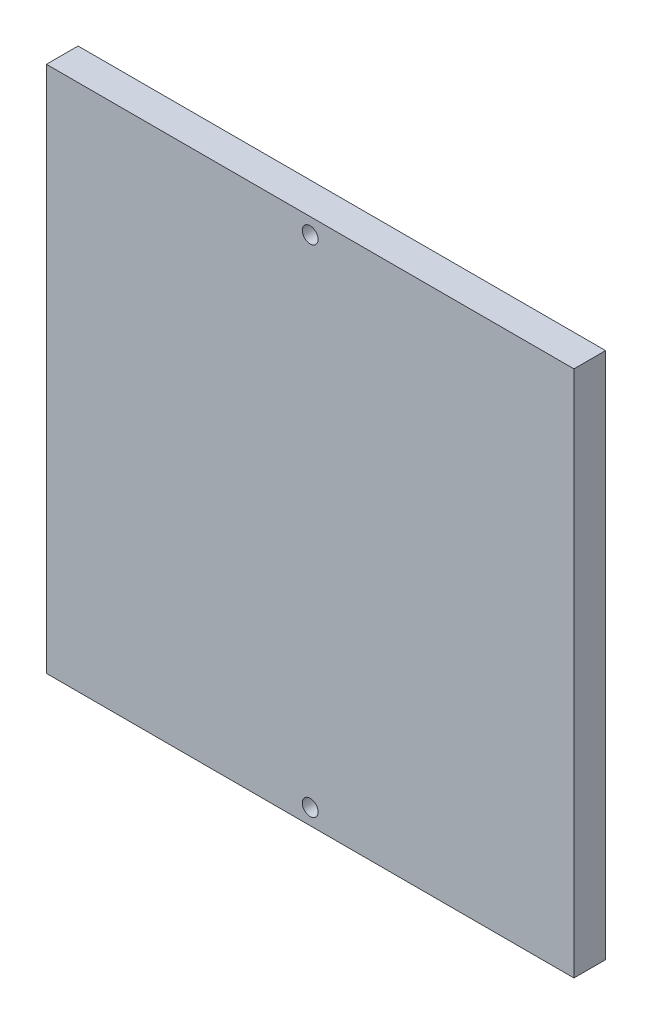
ISO-10303-21;
HEADER;
FILE_DESCRIPTION(('STEP AP214'),'2;1');
FILE_NAME('part.step','',(''),(''),'','','');
FILE_SCHEMA(('AUTOMOTIVE_DESIGN { 1 0 10303 214 1 1 1 1 }'));
ENDSEC;
DATA;
#1=APPLICATION_CONTEXT('core data for automotive mechanical design processes');
#2=APPLICATION_PROTOCOL_DEFINITION('international standard','automotive_design',2000,#1);
#3=PRODUCT_CONTEXT('',#1,'mechanical');
#4=PRODUCT('Part','Part','',(#3));
#5=PRODUCT_RELATED_PRODUCT_CATEGORY('part','',(#4));
#6=PRODUCT_DEFINITION_FORMATION('','',#4);
#7=PRODUCT_DEFINITION_CONTEXT('part definition',#1,'design');
#8=PRODUCT_DEFINITION('design','',#6,#7);
#9=PRODUCT_DEFINITION_SHAPE('','',#8);
#10=(LENGTH_UNIT() NAMED_UNIT(*) SI_UNIT(.MILLI.,.METRE.));
#11=(NAMED_UNIT(*) PLANE_ANGLE_UNIT() SI_UNIT($,.RADIAN.));
#12=(NAMED_UNIT(*) SI_UNIT($,.STERADIAN.) SOLID_ANGLE_UNIT());
#13=UNCERTAINTY_MEASURE_WITH_UNIT(LENGTH_MEASURE(1.E-05),#10,'distance_accuracy_value','');
#14=(GEOMETRIC_REPRESENTATION_CONTEXT(3) GLOBAL_UNCERTAINTY_ASSIGNED_CONTEXT((#13)) GLOBAL_UNIT_ASSIGNED_CONTEXT((#10,
#11,#12)) REPRESENTATION_CONTEXT('',''));
#15=CARTESIAN_POINT('',(0.,0.,0.));
#16=DIRECTION('',(0.,0.,1.));
#17=DIRECTION('',(1.,0.,0.));
#18=AXIS2_PLACEMENT_3D('',#15,#16,#17);
#19=CARTESIAN_POINT('',(0.,0.,6.));
#20=DIRECTION('',(0.,0.,-1.));
#21=DIRECTION('',(-1.,0.,0.));
#22=AXIS2_PLACEMENT_3D('',#19,#20,#21);
#23=PLANE('',#22);
#24=DIRECTION('',(0.,-1.,0.));
#25=VECTOR('',#24,1.);
#26=CARTESIAN_POINT('',(0.,-138.388923903618,6.));
#27=LINE('',#26,#25);
#28=CARTESIAN_POINT('',(0.,-38.3889239036183,6.));
#29=VERTEX_POINT('',#28);
#30=CARTESIAN_POINT('',(0.,-138.388923903618,6.));
#31=VERTEX_POINT('',#30);
#32=EDGE_CURVE('E89',#29,#31,#27,.T.);
#33=ORIENTED_EDGE('',*,*,#32,.T.);
#34=DIRECTION('',(1.,0.,0.));
#35=VECTOR('',#34,1.);
#36=CARTESIAN_POINT('',(100.,-138.388923903618,6.));
#37=LINE('',#36,#35);
#38=CARTESIAN_POINT('',(100.,-138.388923903618,6.));
#39=VERTEX_POINT('',#38);
#40=EDGE_CURVE('E84',#31,#39,#37,.T.);
#41=ORIENTED_EDGE('',*,*,#40,.T.);
#42=DIRECTION('',(0.,1.,0.));
#43=VECTOR('',#42,1.);
#44=CARTESIAN_POINT('',(100.,-38.3889239036183,6.));
#45=LINE('',#44,#43);
#46=CARTESIAN_POINT('',(100.,-38.3889239036183,6.));
#47=VERTEX_POINT('',#46);
#48=EDGE_CURVE('E87',#39,#47,#45,.T.);
#49=ORIENTED_EDGE('',*,*,#48,.T.);
#50=DIRECTION('',(-1.,0.,0.));
#51=VECTOR('',#50,1.);
#52=CARTESIAN_POINT('',(0.,-38.3889239036183,6.));
#53=LINE('',#52,#51);
#54=EDGE_CURVE('E54',#47,#29,#53,.T.);
#55=ORIENTED_EDGE('',*,*,#54,.T.);
#56=EDGE_LOOP('',(#33,#41,#49,#55));
#57=FACE_BOUND('',#56,.T.);
#58=CARTESIAN_POINT('',(50.,-41.3889239036183,6.));
#59=DIRECTION('',(0.,0.,1.));
#60=DIRECTION('',(1.,0.,0.));
#61=AXIS2_PLACEMENT_3D('',#58,#59,#60);
#62=CIRCLE('',#61,1.5);
#63=CARTESIAN_POINT('',(51.5,-41.3889239036183,6.));
#64=VERTEX_POINT('',#63);
#65=EDGE_CURVE('E104',#64,#64,#62,.T.);
#66=ORIENTED_EDGE('',*,*,#65,.F.);
#67=EDGE_LOOP('',(#66));
#68=FACE_BOUND('',#67,.T.);
#69=CARTESIAN_POINT('',(50.,-135.388923903618,6.));
#70=DIRECTION('',(0.,0.,1.));
#71=DIRECTION('',(1.,0.,0.));
#72=AXIS2_PLACEMENT_3D('',#69,#70,#71);
#73=CIRCLE('',#72,1.5);
#74=CARTESIAN_POINT('',(51.5,-135.388923903618,6.));
#75=VERTEX_POINT('',#74);
#76=EDGE_CURVE('E119',#75,#75,#73,.T.);
#77=ORIENTED_EDGE('',*,*,#76,.F.);
#78=EDGE_LOOP('',(#77));
#79=FACE_BOUND('',#78,.T.);
#80=ADVANCED_FACE('F37',(#57,#68,#79),#23,.F.);
#81=CARTESIAN_POINT('',(0.,0.,0.));
#82=DIRECTION('',(0.,0.,-1.));
#83=DIRECTION('',(-1.,0.,0.));
#84=AXIS2_PLACEMENT_3D('',#81,#82,#83);
#85=PLANE('',#84);
#86=CARTESIAN_POINT('',(50.,-41.3889239036183,0.));
#87=DIRECTION('',(0.,0.,1.));
#88=DIRECTION('',(1.,0.,0.));
#89=AXIS2_PLACEMENT_3D('',#86,#87,#88);
#90=CIRCLE('',#89,1.5);
#91=CARTESIAN_POINT('',(51.5,-41.3889239036183,0.));
#92=VERTEX_POINT('',#91);
#93=EDGE_CURVE('E116',#92,#92,#90,.T.);
#94=ORIENTED_EDGE('',*,*,#93,.T.);
#95=EDGE_LOOP('',(#94));
#96=FACE_BOUND('',#95,.T.);
#97=DIRECTION('',(0.,-1.,0.));
#98=VECTOR('',#97,1.);
#99=CARTESIAN_POINT('',(0.,-138.388923903618,0.));
#100=LINE('',#99,#98);
#101=CARTESIAN_POINT('',(0.,-38.3889239036183,0.));
#102=VERTEX_POINT('',#101);
#103=CARTESIAN_POINT('',(0.,-138.388923903618,0.));
#104=VERTEX_POINT('',#103);
#105=EDGE_CURVE('E101',#102,#104,#100,.T.);
#106=ORIENTED_EDGE('',*,*,#105,.F.);
#107=DIRECTION('',(-1.,0.,0.));
#108=VECTOR('',#107,1.);
#109=CARTESIAN_POINT('',(0.,-38.3889239036183,0.));
#110=LINE('',#109,#108);
#111=CARTESIAN_POINT('',(100.,-38.3889239036183,0.));
#112=VERTEX_POINT('',#111);
#113=EDGE_CURVE('E77',#112,#102,#110,.T.);
#114=ORIENTED_EDGE('',*,*,#113,.F.);
#115=DIRECTION('',(0.,1.,0.));
#116=VECTOR('',#115,1.);
#117=CARTESIAN_POINT('',(100.,-38.3889239036183,0.));
#118=LINE('',#117,#116);
#119=CARTESIAN_POINT('',(100.,-138.388923903618,0.));
#120=VERTEX_POINT('',#119);
#121=EDGE_CURVE('E71',#120,#112,#118,.T.);
#122=ORIENTED_EDGE('',*,*,#121,.F.);
#123=DIRECTION('',(1.,0.,0.));
#124=VECTOR('',#123,1.);
#125=CARTESIAN_POINT('',(100.,-138.388923903618,0.));
#126=LINE('',#125,#124);
#127=EDGE_CURVE('E93',#104,#120,#126,.T.);
#128=ORIENTED_EDGE('',*,*,#127,.F.);
#129=EDGE_LOOP('',(#106,#114,#122,#128));
#130=FACE_BOUND('',#129,.T.);
#131=CARTESIAN_POINT('',(50.,-135.388923903618,0.));
#132=DIRECTION('',(0.,0.,1.));
#133=DIRECTION('',(1.,0.,0.));
#134=AXIS2_PLACEMENT_3D('',#131,#132,#133);
#135=CIRCLE('',#134,1.5);
#136=CARTESIAN_POINT('',(51.5,-135.388923903618,0.));
#137=VERTEX_POINT('',#136);
#138=EDGE_CURVE('E122',#137,#137,#135,.T.);
#139=ORIENTED_EDGE('',*,*,#138,.T.);
#140=EDGE_LOOP('',(#139));
#141=FACE_BOUND('',#140,.T.);
#142=ADVANCED_FACE('F112',(#96,#130,#141),#85,.T.);
#143=CARTESIAN_POINT('',(0.,-138.388923903618,6.));
#144=DIRECTION('',(1.,0.,0.));
#145=DIRECTION('',(0.,0.,-1.));
#146=AXIS2_PLACEMENT_3D('',#143,#144,#145);
#147=PLANE('',#146);
#148=ORIENTED_EDGE('',*,*,#105,.T.);
#149=DIRECTION('',(0.,0.,-1.));
#150=VECTOR('',#149,1.);
#151=CARTESIAN_POINT('',(0.,-138.388923903618,6.));
#152=LINE('',#151,#150);
#153=EDGE_CURVE('E11',#31,#104,#152,.T.);
#154=ORIENTED_EDGE('',*,*,#153,.F.);
#155=ORIENTED_EDGE('',*,*,#32,.F.);
#156=DIRECTION('',(0.,0.,-1.));
#157=VECTOR('',#156,1.);
#158=CARTESIAN_POINT('',(0.,-38.3889239036183,6.));
#159=LINE('',#158,#157);
#160=EDGE_CURVE('E97',#29,#102,#159,.T.);
#161=ORIENTED_EDGE('',*,*,#160,.T.);
#162=EDGE_LOOP('',(#148,#154,#155,#161));
#163=FACE_BOUND('',#162,.T.);
#164=ADVANCED_FACE('F39',(#163),#147,.F.);
#165=CARTESIAN_POINT('',(100.,-138.388923903618,6.));
#166=DIRECTION('',(0.,1.,0.));
#167=DIRECTION('',(0.,0.,1.));
#168=AXIS2_PLACEMENT_3D('',#165,#166,#167);
#169=PLANE('',#168);
#170=ORIENTED_EDGE('',*,*,#127,.T.);
#171=DIRECTION('',(0.,0.,-1.));
#172=VECTOR('',#171,1.);
#173=CARTESIAN_POINT('',(100.,-138.388923903618,6.));
#174=LINE('',#173,#172);
#175=EDGE_CURVE('E46',#39,#120,#174,.T.);
#176=ORIENTED_EDGE('',*,*,#175,.F.);
#177=ORIENTED_EDGE('',*,*,#40,.F.);
#178=ORIENTED_EDGE('',*,*,#153,.T.);
#179=EDGE_LOOP('',(#170,#176,#177,#178));
#180=FACE_BOUND('',#179,.T.);
#181=ADVANCED_FACE('F92',(#180),#169,.F.);
#182=CARTESIAN_POINT('',(100.,-38.3889239036183,6.));
#183=DIRECTION('',(-1.,0.,0.));
#184=DIRECTION('',(0.,0.,1.));
#185=AXIS2_PLACEMENT_3D('',#182,#183,#184);
#186=PLANE('',#185);
#187=ORIENTED_EDGE('',*,*,#121,.T.);
#188=DIRECTION('',(0.,0.,-1.));
#189=VECTOR('',#188,1.);
#190=CARTESIAN_POINT('',(100.,-38.3889239036183,6.));
#191=LINE('',#190,#189);
#192=EDGE_CURVE('E94',#47,#112,#191,.T.);
#193=ORIENTED_EDGE('',*,*,#192,.F.);
#194=ORIENTED_EDGE('',*,*,#48,.F.);
#195=ORIENTED_EDGE('',*,*,#175,.T.);
#196=EDGE_LOOP('',(#187,#193,#194,#195));
#197=FACE_BOUND('',#196,.T.);
#198=ADVANCED_FACE('F95',(#197),#186,.F.);
#199=CARTESIAN_POINT('',(0.,-38.3889239036183,6.));
#200=DIRECTION('',(0.,-1.,0.));
#201=DIRECTION('',(0.,0.,-1.));
#202=AXIS2_PLACEMENT_3D('',#199,#200,#201);
#203=PLANE('',#202);
#204=ORIENTED_EDGE('',*,*,#113,.T.);
#205=ORIENTED_EDGE('',*,*,#160,.F.);
#206=ORIENTED_EDGE('',*,*,#54,.F.);
#207=ORIENTED_EDGE('',*,*,#192,.T.);
#208=EDGE_LOOP('',(#204,#205,#206,#207));
#209=FACE_BOUND('',#208,.T.);
#210=ADVANCED_FACE('F109',(#209),#203,.F.);
#211=CARTESIAN_POINT('',(50.,-41.3889239036183,6.));
#212=DIRECTION('',(0.,0.,-1.));
#213=DIRECTION('',(-1.,0.,0.));
#214=AXIS2_PLACEMENT_3D('',#211,#212,#213);
#215=CYLINDRICAL_SURFACE('',#214,1.5);
#216=ORIENTED_EDGE('',*,*,#65,.T.);
#217=EDGE_LOOP('',(#216));
#218=FACE_BOUND('',#217,.T.);
#219=ORIENTED_EDGE('',*,*,#93,.F.);
#220=EDGE_LOOP('',(#219));
#221=FACE_BOUND('',#220,.T.);
#222=ADVANCED_FACE('F139',(#218,#221),#215,.F.);
#223=CARTESIAN_POINT('',(50.,-135.388923903618,6.));
#224=DIRECTION('',(0.,0.,-1.));
#225=DIRECTION('',(-1.,0.,0.));
#226=AXIS2_PLACEMENT_3D('',#223,#224,#225);
#227=CYLINDRICAL_SURFACE('',#226,1.5);
#228=ORIENTED_EDGE('',*,*,#76,.T.);
#229=EDGE_LOOP('',(#228));
#230=FACE_BOUND('',#229,.T.);
#231=ORIENTED_EDGE('',*,*,#138,.F.);
#232=EDGE_LOOP('',(#231));
#233=FACE_BOUND('',#232,.T.);
#234=ADVANCED_FACE('F128',(#230,#233),#227,.F.);
#235=CLOSED_SHELL('',(#80,#142,#164,#181,#198,#210,#222,#234));
#236=MANIFOLD_SOLID_BREP('B2',#235);
#237=ADVANCED_BREP_SHAPE_REPRESENTATION('',(#18,#236),#14);
#238=SHAPE_DEFINITION_REPRESENTATION(#9,#237);
ENDSEC;
END-ISO-10303-21;
